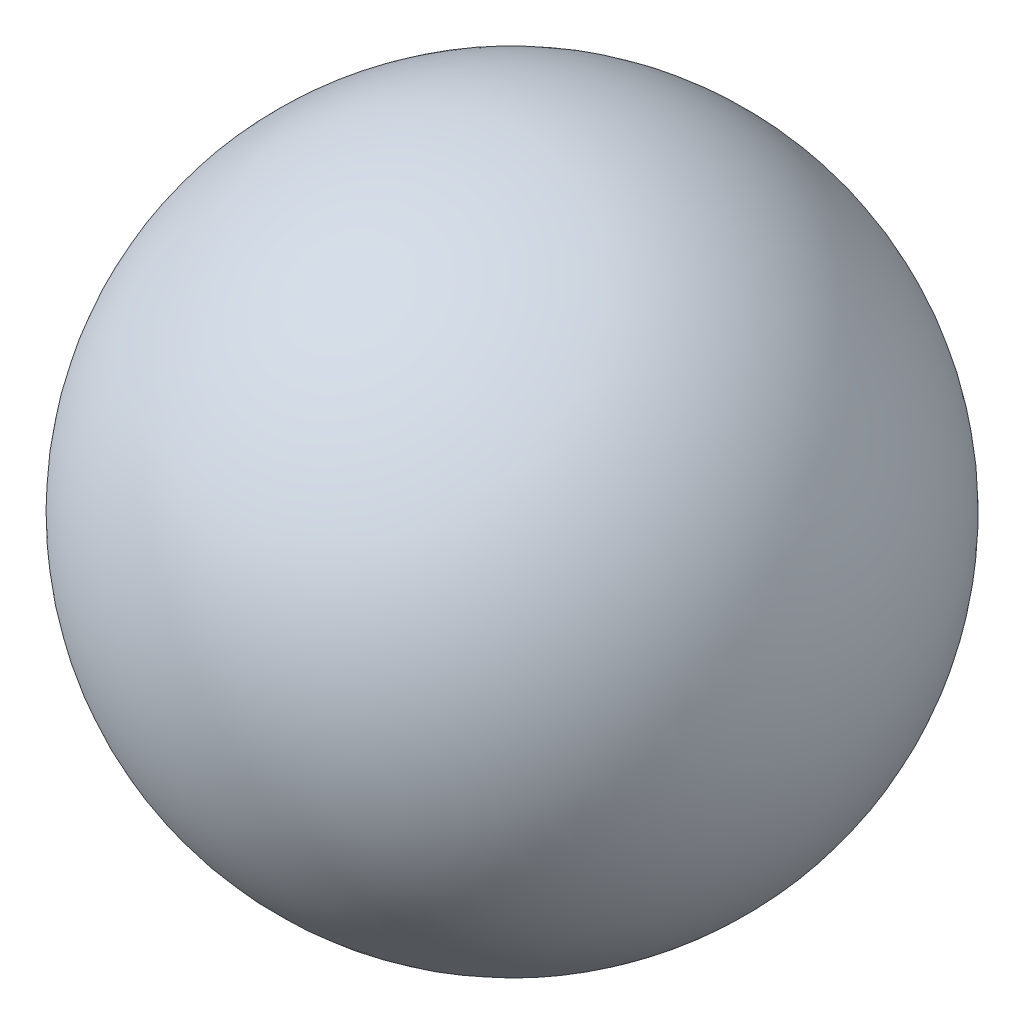
ISO-10303-21;
HEADER;
FILE_DESCRIPTION(('STEP AP214'),'2;1');
FILE_NAME('part.step','',(''),(''),'','','');
FILE_SCHEMA(('AUTOMOTIVE_DESIGN { 1 0 10303 214 1 1 1 1 }'));
ENDSEC;
DATA;
#1=APPLICATION_CONTEXT('core data for automotive mechanical design processes');
#2=APPLICATION_PROTOCOL_DEFINITION('international standard','automotive_design',2000,#1);
#3=PRODUCT_CONTEXT('',#1,'mechanical');
#4=PRODUCT('Part','Part','',(#3));
#5=PRODUCT_RELATED_PRODUCT_CATEGORY('part','',(#4));
#6=PRODUCT_DEFINITION_FORMATION('','',#4);
#7=PRODUCT_DEFINITION_CONTEXT('part definition',#1,'design');
#8=PRODUCT_DEFINITION('design','',#6,#7);
#9=PRODUCT_DEFINITION_SHAPE('','',#8);
#10=(LENGTH_UNIT() NAMED_UNIT(*) SI_UNIT(.MILLI.,.METRE.));
#11=(NAMED_UNIT(*) PLANE_ANGLE_UNIT() SI_UNIT($,.RADIAN.));
#12=(NAMED_UNIT(*) SI_UNIT($,.STERADIAN.) SOLID_ANGLE_UNIT());
#13=UNCERTAINTY_MEASURE_WITH_UNIT(LENGTH_MEASURE(1.E-05),#10,'distance_accuracy_value','');
#14=(GEOMETRIC_REPRESENTATION_CONTEXT(3) GLOBAL_UNCERTAINTY_ASSIGNED_CONTEXT((#13)) GLOBAL_UNIT_ASSIGNED_CONTEXT((#10,
#11,#12)) REPRESENTATION_CONTEXT('',''));
#15=CARTESIAN_POINT('',(0.,0.,0.));
#16=DIRECTION('',(0.,0.,1.));
#17=DIRECTION('',(1.,0.,0.));
#18=AXIS2_PLACEMENT_3D('',#15,#16,#17);
#19=CARTESIAN_POINT('',(64.16,65.1716395731653,23.8045811629913));
#20=DIRECTION('',(0.,0.939302704886864,0.343089534367082));
#21=DIRECTION('',(0.173648177666933,-0.337877233422051,0.925032586197921));
#22=AXIS2_PLACEMENT_3D('',#19,#20,#21);
#23=SPHERICAL_SURFACE('',#22,7.15);
#24=CARTESIAN_POINT('',(64.16,58.4556252332242,21.3514909922667));
#25=VERTEX_POINT('',#24);
#26=VERTEX_LOOP('',#25);
#27=FACE_BOUND('',#26,.T.);
#28=CARTESIAN_POINT('',(64.16,71.8876539131064,26.2576713337159));
#29=VERTEX_POINT('',#28);
#30=VERTEX_LOOP('',#29);
#31=FACE_BOUND('',#30,.T.);
#32=ADVANCED_FACE('F16',(#27,#31),#23,.T.);
#33=CLOSED_SHELL('',(#32));
#34=MANIFOLD_SOLID_BREP('B1',#33);
#35=ADVANCED_BREP_SHAPE_REPRESENTATION('',(#18,#34),#14);
#36=SHAPE_DEFINITION_REPRESENTATION(#9,#35);
ENDSEC;
END-ISO-10303-21;
